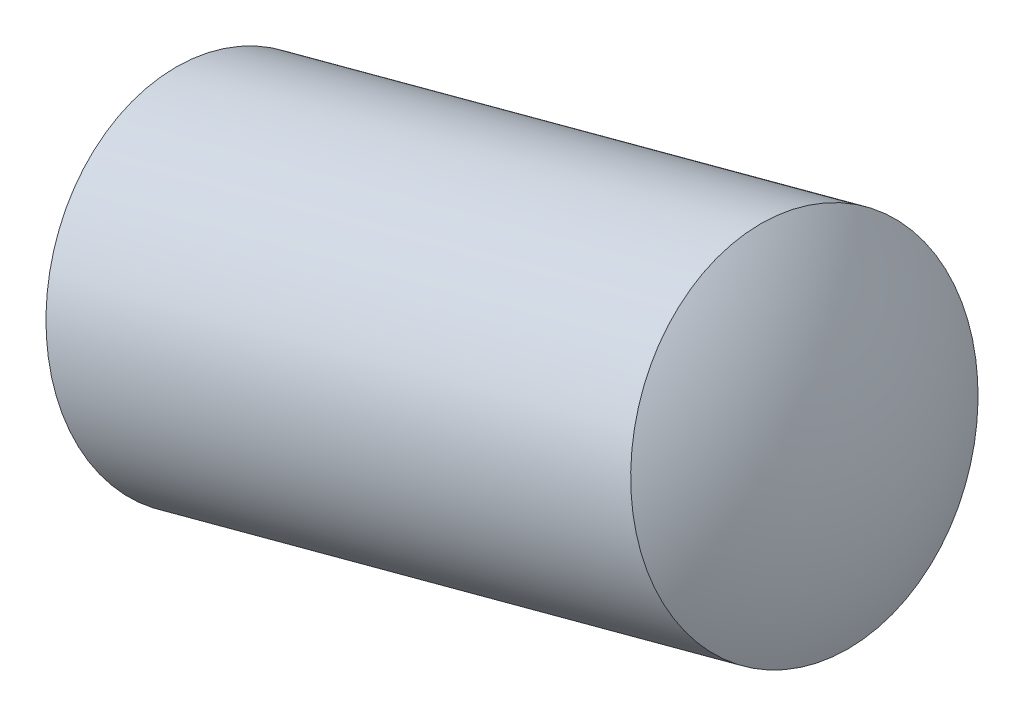
ISO-10303-21;
HEADER;
FILE_DESCRIPTION(('STEP AP214'),'2;1');
FILE_NAME('part.step','',(''),(''),'','','');
FILE_SCHEMA(('AUTOMOTIVE_DESIGN { 1 0 10303 214 1 1 1 1 }'));
ENDSEC;
DATA;
#1=APPLICATION_CONTEXT('core data for automotive mechanical design processes');
#2=APPLICATION_PROTOCOL_DEFINITION('international standard','automotive_design',2000,#1);
#3=PRODUCT_CONTEXT('',#1,'mechanical');
#4=PRODUCT('Part','Part','',(#3));
#5=PRODUCT_RELATED_PRODUCT_CATEGORY('part','',(#4));
#6=PRODUCT_DEFINITION_FORMATION('','',#4);
#7=PRODUCT_DEFINITION_CONTEXT('part definition',#1,'design');
#8=PRODUCT_DEFINITION('design','',#6,#7);
#9=PRODUCT_DEFINITION_SHAPE('','',#8);
#10=(LENGTH_UNIT() NAMED_UNIT(*) SI_UNIT(.MILLI.,.METRE.));
#11=(NAMED_UNIT(*) PLANE_ANGLE_UNIT() SI_UNIT($,.RADIAN.));
#12=(NAMED_UNIT(*) SI_UNIT($,.STERADIAN.) SOLID_ANGLE_UNIT());
#13=UNCERTAINTY_MEASURE_WITH_UNIT(LENGTH_MEASURE(1.E-05),#10,'distance_accuracy_value','');
#14=(GEOMETRIC_REPRESENTATION_CONTEXT(3) GLOBAL_UNCERTAINTY_ASSIGNED_CONTEXT((#13)) GLOBAL_UNIT_ASSIGNED_CONTEXT((#10,
#11,#12)) REPRESENTATION_CONTEXT('',''));
#15=CARTESIAN_POINT('',(0.,0.,0.));
#16=DIRECTION('',(0.,0.,1.));
#17=DIRECTION('',(1.,0.,0.));
#18=AXIS2_PLACEMENT_3D('',#15,#16,#17);
#19=CARTESIAN_POINT('',(26.6614110427164,7.14390355797012,0.9));
#20=DIRECTION('',(0.258819045102521,-0.965925826289068,0.));
#21=DIRECTION('',(0.965925826289068,0.258819045102521,0.));
#22=AXIS2_PLACEMENT_3D('',#19,#20,#21);
#23=SPHERICAL_SURFACE('',#22,3.);
#24=CARTESIAN_POINT('',(26.6614110427164,7.14390355797012,0.9));
#25=DIRECTION('',(-0.965925826289068,-0.258819045102521,0.));
#26=DIRECTION('',(0.,0.,-1.));
#27=AXIS2_PLACEMENT_3D('',#24,#25,#26);
#28=SPHERICAL_SURFACE('',#27,3.);
#29=CARTESIAN_POINT('',(29.1709599539299,7.81633516209612,0.9));
#30=DIRECTION('',(-0.965925826289068,-0.258819045102521,0.));
#31=DIRECTION('',(0.,0.,-1.));
#32=AXIS2_PLACEMENT_3D('',#29,#30,#31);
#33=CIRCLE('',#32,1.5);
#34=CARTESIAN_POINT('',(29.1709599539299,7.81633516209612,-0.6));
#35=VERTEX_POINT('',#34);
#36=EDGE_CURVE('E11',#35,#35,#33,.T.);
#37=ORIENTED_EDGE('',*,*,#36,.F.);
#38=EDGE_LOOP('',(#37));
#39=FACE_BOUND('',#38,.T.);
#40=ADVANCED_FACE('F17',(#39),#28,.T.);
#41=CARTESIAN_POINT('',(26.4645094031823,7.09114392266852,0.9));
#42=DIRECTION('',(0.258819045102521,-0.965925826289068,0.));
#43=DIRECTION('',(-0.965925826289068,-0.258819045102521,0.));
#44=AXIS2_PLACEMENT_3D('',#41,#42,#43);
#45=SPHERICAL_SURFACE('',#44,3.);
#46=CARTESIAN_POINT('',(26.4645094031823,7.09114392266852,0.9));
#47=DIRECTION('',(-0.965925826289068,-0.258819045102521,0.));
#48=DIRECTION('',(0.,0.,-1.));
#49=AXIS2_PLACEMENT_3D('',#46,#47,#48);
#50=SPHERICAL_SURFACE('',#49,3.);
#51=CARTESIAN_POINT('',(23.9549604919689,6.41871231854252,0.9));
#52=DIRECTION('',(-0.965925826289068,-0.258819045102521,0.));
#53=DIRECTION('',(0.,0.,-1.));
#54=AXIS2_PLACEMENT_3D('',#51,#52,#53);
#55=CIRCLE('',#54,1.5);
#56=CARTESIAN_POINT('',(23.9549604919689,6.41871231854252,-0.6));
#57=VERTEX_POINT('',#56);
#58=EDGE_CURVE('E27',#57,#57,#55,.T.);
#59=ORIENTED_EDGE('',*,*,#58,.T.);
#60=EDGE_LOOP('',(#59));
#61=FACE_BOUND('',#60,.T.);
#62=ADVANCED_FACE('F19',(#61),#50,.T.);
#63=CARTESIAN_POINT('',(25.2589603574591,6.76811802943089,0.9));
#64=DIRECTION('',(-0.965925826289068,-0.258819045102521,0.));
#65=DIRECTION('',(0.,0.,-1.));
#66=AXIS2_PLACEMENT_3D('',#63,#64,#65);
#67=CYLINDRICAL_SURFACE('',#66,1.5);
#68=ORIENTED_EDGE('',*,*,#36,.T.);
#69=EDGE_LOOP('',(#68));
#70=FACE_BOUND('',#69,.T.);
#71=ORIENTED_EDGE('',*,*,#58,.F.);
#72=EDGE_LOOP('',(#71));
#73=FACE_BOUND('',#72,.T.);
#74=ADVANCED_FACE('F47',(#70,#73),#67,.T.);
#75=CLOSED_SHELL('',(#40,#62,#74));
#76=MANIFOLD_SOLID_BREP('B1',#75);
#77=ADVANCED_BREP_SHAPE_REPRESENTATION('',(#18,#76),#14);
#78=SHAPE_DEFINITION_REPRESENTATION(#9,#77);
ENDSEC;
END-ISO-10303-21;
